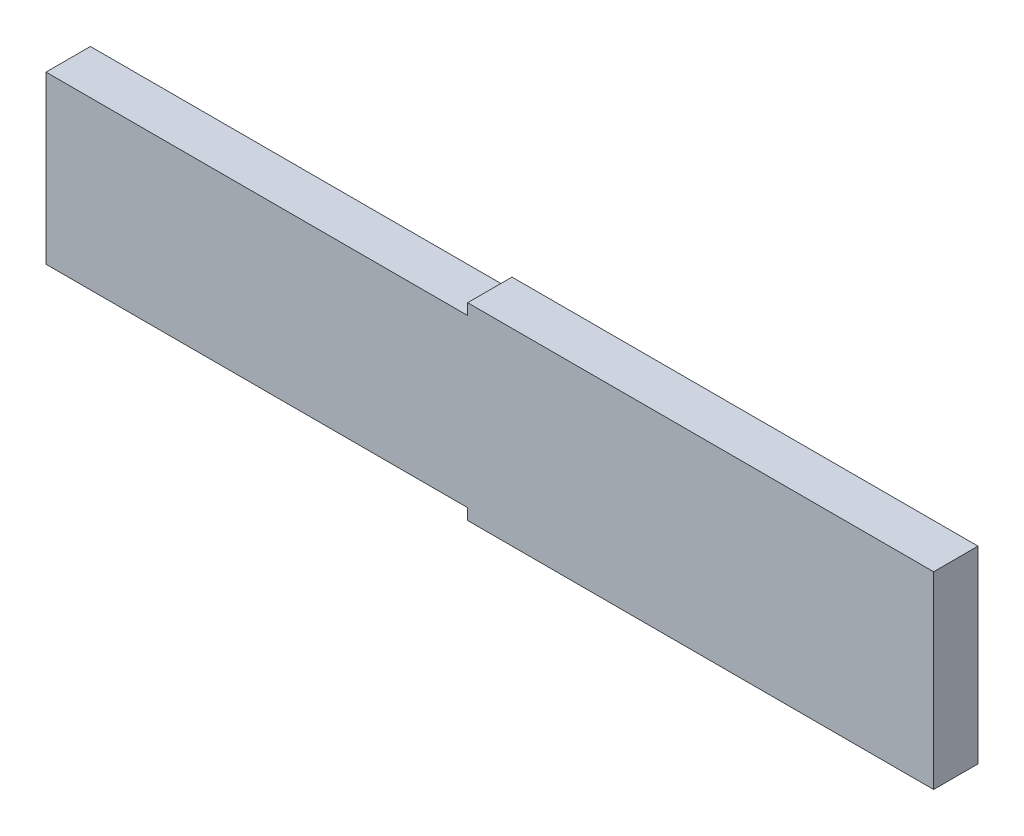
ISO-10303-21;
HEADER;
FILE_DESCRIPTION(('STEP AP214'),'2;1');
FILE_NAME('part.step','',(''),(''),'','','');
FILE_SCHEMA(('AUTOMOTIVE_DESIGN { 1 0 10303 214 1 1 1 1 }'));
ENDSEC;
DATA;
#1=APPLICATION_CONTEXT('core data for automotive mechanical design processes');
#2=APPLICATION_PROTOCOL_DEFINITION('international standard','automotive_design',2000,#1);
#3=PRODUCT_CONTEXT('',#1,'mechanical');
#4=PRODUCT('Part','Part','',(#3));
#5=PRODUCT_RELATED_PRODUCT_CATEGORY('part','',(#4));
#6=PRODUCT_DEFINITION_FORMATION('','',#4);
#7=PRODUCT_DEFINITION_CONTEXT('part definition',#1,'design');
#8=PRODUCT_DEFINITION('design','',#6,#7);
#9=PRODUCT_DEFINITION_SHAPE('','',#8);
#10=(LENGTH_UNIT() NAMED_UNIT(*) SI_UNIT(.MILLI.,.METRE.));
#11=(NAMED_UNIT(*) PLANE_ANGLE_UNIT() SI_UNIT($,.RADIAN.));
#12=(NAMED_UNIT(*) SI_UNIT($,.STERADIAN.) SOLID_ANGLE_UNIT());
#13=UNCERTAINTY_MEASURE_WITH_UNIT(LENGTH_MEASURE(1.E-05),#10,'distance_accuracy_value','');
#14=(GEOMETRIC_REPRESENTATION_CONTEXT(3) GLOBAL_UNCERTAINTY_ASSIGNED_CONTEXT((#13)) GLOBAL_UNIT_ASSIGNED_CONTEXT((#10,
#11,#12)) REPRESENTATION_CONTEXT('',''));
#15=CARTESIAN_POINT('',(0.,0.,0.));
#16=DIRECTION('',(0.,0.,1.));
#17=DIRECTION('',(1.,0.,0.));
#18=AXIS2_PLACEMENT_3D('',#15,#16,#17);
#19=CARTESIAN_POINT('',(-38.,7.5,4.));
#20=DIRECTION('',(0.,-1.,0.));
#21=DIRECTION('',(0.,0.,-1.));
#22=AXIS2_PLACEMENT_3D('',#19,#20,#21);
#23=PLANE('',#22);
#24=DIRECTION('',(-1.,0.,0.));
#25=VECTOR('',#24,1.);
#26=CARTESIAN_POINT('',(-38.,7.5,0.));
#27=LINE('',#26,#25);
#28=CARTESIAN_POINT('',(0.,7.5,0.));
#29=VERTEX_POINT('',#28);
#30=CARTESIAN_POINT('',(-38.,7.5,0.));
#31=VERTEX_POINT('',#30);
#32=EDGE_CURVE('E129',#29,#31,#27,.T.);
#33=ORIENTED_EDGE('',*,*,#32,.T.);
#34=DIRECTION('',(0.,0.,-1.));
#35=VECTOR('',#34,1.);
#36=CARTESIAN_POINT('',(-38.,7.5,4.));
#37=LINE('',#36,#35);
#38=CARTESIAN_POINT('',(-38.,7.5,4.));
#39=VERTEX_POINT('',#38);
#40=EDGE_CURVE('E11',#39,#31,#37,.T.);
#41=ORIENTED_EDGE('',*,*,#40,.F.);
#42=DIRECTION('',(-1.,0.,0.));
#43=VECTOR('',#42,1.);
#44=CARTESIAN_POINT('',(-38.,7.5,4.));
#45=LINE('',#44,#43);
#46=CARTESIAN_POINT('',(0.,7.5,4.));
#47=VERTEX_POINT('',#46);
#48=EDGE_CURVE('E143',#47,#39,#45,.T.);
#49=ORIENTED_EDGE('',*,*,#48,.F.);
#50=DIRECTION('',(0.,0.,-1.));
#51=VECTOR('',#50,1.);
#52=CARTESIAN_POINT('',(0.,7.5,4.));
#53=LINE('',#52,#51);
#54=EDGE_CURVE('E125',#47,#29,#53,.T.);
#55=ORIENTED_EDGE('',*,*,#54,.T.);
#56=EDGE_LOOP('',(#33,#41,#49,#55));
#57=FACE_BOUND('',#56,.T.);
#58=ADVANCED_FACE('F33',(#57),#23,.F.);
#59=CARTESIAN_POINT('',(-38.,-7.5,4.));
#60=DIRECTION('',(1.,0.,0.));
#61=DIRECTION('',(0.,0.,-1.));
#62=AXIS2_PLACEMENT_3D('',#59,#60,#61);
#63=PLANE('',#62);
#64=DIRECTION('',(0.,-1.,0.));
#65=VECTOR('',#64,1.);
#66=CARTESIAN_POINT('',(-38.,-7.5,0.));
#67=LINE('',#66,#65);
#68=CARTESIAN_POINT('',(-38.,-7.5,0.));
#69=VERTEX_POINT('',#68);
#70=EDGE_CURVE('E132',#31,#69,#67,.T.);
#71=ORIENTED_EDGE('',*,*,#70,.T.);
#72=DIRECTION('',(0.,0.,-1.));
#73=VECTOR('',#72,1.);
#74=CARTESIAN_POINT('',(-38.,-7.5,4.));
#75=LINE('',#74,#73);
#76=CARTESIAN_POINT('',(-38.,-7.5,4.));
#77=VERTEX_POINT('',#76);
#78=EDGE_CURVE('E41',#77,#69,#75,.T.);
#79=ORIENTED_EDGE('',*,*,#78,.F.);
#80=DIRECTION('',(0.,-1.,0.));
#81=VECTOR('',#80,1.);
#82=CARTESIAN_POINT('',(-38.,-7.5,4.));
#83=LINE('',#82,#81);
#84=EDGE_CURVE('E92',#39,#77,#83,.T.);
#85=ORIENTED_EDGE('',*,*,#84,.F.);
#86=ORIENTED_EDGE('',*,*,#40,.T.);
#87=EDGE_LOOP('',(#71,#79,#85,#86));
#88=FACE_BOUND('',#87,.T.);
#89=ADVANCED_FACE('F178',(#88),#63,.F.);
#90=CARTESIAN_POINT('',(-38.,-7.5,4.));
#91=DIRECTION('',(0.,1.,0.));
#92=DIRECTION('',(0.,0.,1.));
#93=AXIS2_PLACEMENT_3D('',#90,#91,#92);
#94=PLANE('',#93);
#95=DIRECTION('',(1.,0.,0.));
#96=VECTOR('',#95,1.);
#97=CARTESIAN_POINT('',(-38.,-7.5,0.));
#98=LINE('',#97,#96);
#99=CARTESIAN_POINT('',(0.,-7.5,0.));
#100=VERTEX_POINT('',#99);
#101=EDGE_CURVE('E134',#69,#100,#98,.T.);
#102=ORIENTED_EDGE('',*,*,#101,.T.);
#103=DIRECTION('',(0.,0.,-1.));
#104=VECTOR('',#103,1.);
#105=CARTESIAN_POINT('',(0.,-7.5,4.));
#106=LINE('',#105,#104);
#107=CARTESIAN_POINT('',(0.,-7.5,4.));
#108=VERTEX_POINT('',#107);
#109=EDGE_CURVE('E150',#108,#100,#106,.T.);
#110=ORIENTED_EDGE('',*,*,#109,.F.);
#111=DIRECTION('',(1.,0.,0.));
#112=VECTOR('',#111,1.);
#113=CARTESIAN_POINT('',(-38.,-7.5,4.));
#114=LINE('',#113,#112);
#115=EDGE_CURVE('E158',#77,#108,#114,.T.);
#116=ORIENTED_EDGE('',*,*,#115,.F.);
#117=ORIENTED_EDGE('',*,*,#78,.T.);
#118=EDGE_LOOP('',(#102,#110,#116,#117));
#119=FACE_BOUND('',#118,.T.);
#120=ADVANCED_FACE('F156',(#119),#94,.F.);
#121=CARTESIAN_POINT('',(0.,-7.5,4.));
#122=DIRECTION('',(1.,0.,0.));
#123=DIRECTION('',(0.,0.,-1.));
#124=AXIS2_PLACEMENT_3D('',#121,#122,#123);
#125=PLANE('',#124);
#126=DIRECTION('',(0.,-1.,0.));
#127=VECTOR('',#126,1.);
#128=CARTESIAN_POINT('',(0.,-7.5,0.));
#129=LINE('',#128,#127);
#130=CARTESIAN_POINT('',(0.,-8.50000000000001,0.));
#131=VERTEX_POINT('',#130);
#132=EDGE_CURVE('E136',#100,#131,#129,.T.);
#133=ORIENTED_EDGE('',*,*,#132,.T.);
#134=DIRECTION('',(0.,0.,-1.));
#135=VECTOR('',#134,1.);
#136=CARTESIAN_POINT('',(0.,-8.50000000000001,4.));
#137=LINE('',#136,#135);
#138=CARTESIAN_POINT('',(0.,-8.50000000000001,4.));
#139=VERTEX_POINT('',#138);
#140=EDGE_CURVE('E147',#139,#131,#137,.T.);
#141=ORIENTED_EDGE('',*,*,#140,.F.);
#142=DIRECTION('',(0.,-1.,0.));
#143=VECTOR('',#142,1.);
#144=CARTESIAN_POINT('',(0.,-7.5,4.));
#145=LINE('',#144,#143);
#146=EDGE_CURVE('E170',#108,#139,#145,.T.);
#147=ORIENTED_EDGE('',*,*,#146,.F.);
#148=ORIENTED_EDGE('',*,*,#109,.T.);
#149=EDGE_LOOP('',(#133,#141,#147,#148));
#150=FACE_BOUND('',#149,.T.);
#151=ADVANCED_FACE('F166',(#150),#125,.F.);
#152=CARTESIAN_POINT('',(0.,-8.50000000000001,4.));
#153=DIRECTION('',(0.,1.,0.));
#154=DIRECTION('',(0.,0.,1.));
#155=AXIS2_PLACEMENT_3D('',#152,#153,#154);
#156=PLANE('',#155);
#157=DIRECTION('',(1.,0.,0.));
#158=VECTOR('',#157,1.);
#159=CARTESIAN_POINT('',(0.,-8.50000000000001,0.));
#160=LINE('',#159,#158);
#161=CARTESIAN_POINT('',(42.,-8.50000000000001,0.));
#162=VERTEX_POINT('',#161);
#163=EDGE_CURVE('E138',#131,#162,#160,.T.);
#164=ORIENTED_EDGE('',*,*,#163,.T.);
#165=DIRECTION('',(0.,0.,-1.));
#166=VECTOR('',#165,1.);
#167=CARTESIAN_POINT('',(42.,-8.50000000000001,4.));
#168=LINE('',#167,#166);
#169=CARTESIAN_POINT('',(42.,-8.50000000000001,4.));
#170=VERTEX_POINT('',#169);
#171=EDGE_CURVE('E120',#170,#162,#168,.T.);
#172=ORIENTED_EDGE('',*,*,#171,.F.);
#173=DIRECTION('',(1.,0.,0.));
#174=VECTOR('',#173,1.);
#175=CARTESIAN_POINT('',(0.,-8.50000000000001,4.));
#176=LINE('',#175,#174);
#177=EDGE_CURVE('E111',#139,#170,#176,.T.);
#178=ORIENTED_EDGE('',*,*,#177,.F.);
#179=ORIENTED_EDGE('',*,*,#140,.T.);
#180=EDGE_LOOP('',(#164,#172,#178,#179));
#181=FACE_BOUND('',#180,.T.);
#182=ADVANCED_FACE('F169',(#181),#156,.F.);
#183=CARTESIAN_POINT('',(42.,8.50000000000001,4.));
#184=DIRECTION('',(-1.,0.,0.));
#185=DIRECTION('',(0.,0.,1.));
#186=AXIS2_PLACEMENT_3D('',#183,#184,#185);
#187=PLANE('',#186);
#188=DIRECTION('',(0.,1.,0.));
#189=VECTOR('',#188,1.);
#190=CARTESIAN_POINT('',(42.,8.50000000000001,0.));
#191=LINE('',#190,#189);
#192=CARTESIAN_POINT('',(42.,8.50000000000001,0.));
#193=VERTEX_POINT('',#192);
#194=EDGE_CURVE('E119',#162,#193,#191,.T.);
#195=ORIENTED_EDGE('',*,*,#194,.T.);
#196=DIRECTION('',(0.,0.,-1.));
#197=VECTOR('',#196,1.);
#198=CARTESIAN_POINT('',(42.,8.50000000000001,4.));
#199=LINE('',#198,#197);
#200=CARTESIAN_POINT('',(42.,8.50000000000001,4.));
#201=VERTEX_POINT('',#200);
#202=EDGE_CURVE('E116',#201,#193,#199,.T.);
#203=ORIENTED_EDGE('',*,*,#202,.F.);
#204=DIRECTION('',(0.,1.,0.));
#205=VECTOR('',#204,1.);
#206=CARTESIAN_POINT('',(42.,8.50000000000001,4.));
#207=LINE('',#206,#205);
#208=EDGE_CURVE('E105',#170,#201,#207,.T.);
#209=ORIENTED_EDGE('',*,*,#208,.F.);
#210=ORIENTED_EDGE('',*,*,#171,.T.);
#211=EDGE_LOOP('',(#195,#203,#209,#210));
#212=FACE_BOUND('',#211,.T.);
#213=ADVANCED_FACE('F117',(#212),#187,.F.);
#214=CARTESIAN_POINT('',(0.,8.50000000000001,4.));
#215=DIRECTION('',(0.,-1.,0.));
#216=DIRECTION('',(0.,0.,-1.));
#217=AXIS2_PLACEMENT_3D('',#214,#215,#216);
#218=PLANE('',#217);
#219=DIRECTION('',(-1.,0.,0.));
#220=VECTOR('',#219,1.);
#221=CARTESIAN_POINT('',(0.,8.50000000000001,0.));
#222=LINE('',#221,#220);
#223=CARTESIAN_POINT('',(0.,8.50000000000001,0.));
#224=VERTEX_POINT('',#223);
#225=EDGE_CURVE('E78',#193,#224,#222,.T.);
#226=ORIENTED_EDGE('',*,*,#225,.T.);
#227=DIRECTION('',(0.,0.,-1.));
#228=VECTOR('',#227,1.);
#229=CARTESIAN_POINT('',(0.,8.50000000000001,4.));
#230=LINE('',#229,#228);
#231=CARTESIAN_POINT('',(0.,8.50000000000001,4.));
#232=VERTEX_POINT('',#231);
#233=EDGE_CURVE('E121',#232,#224,#230,.T.);
#234=ORIENTED_EDGE('',*,*,#233,.F.);
#235=DIRECTION('',(-1.,0.,0.));
#236=VECTOR('',#235,1.);
#237=CARTESIAN_POINT('',(0.,8.50000000000001,4.));
#238=LINE('',#237,#236);
#239=EDGE_CURVE('E109',#201,#232,#238,.T.);
#240=ORIENTED_EDGE('',*,*,#239,.F.);
#241=ORIENTED_EDGE('',*,*,#202,.T.);
#242=EDGE_LOOP('',(#226,#234,#240,#241));
#243=FACE_BOUND('',#242,.T.);
#244=ADVANCED_FACE('F123',(#243),#218,.F.);
#245=CARTESIAN_POINT('',(0.,7.5,4.));
#246=DIRECTION('',(1.,0.,0.));
#247=DIRECTION('',(0.,0.,-1.));
#248=AXIS2_PLACEMENT_3D('',#245,#246,#247);
#249=PLANE('',#248);
#250=DIRECTION('',(0.,-1.,0.));
#251=VECTOR('',#250,1.);
#252=CARTESIAN_POINT('',(0.,7.5,0.));
#253=LINE('',#252,#251);
#254=EDGE_CURVE('E84',#224,#29,#253,.T.);
#255=ORIENTED_EDGE('',*,*,#254,.T.);
#256=ORIENTED_EDGE('',*,*,#54,.F.);
#257=DIRECTION('',(0.,-1.,0.));
#258=VECTOR('',#257,1.);
#259=CARTESIAN_POINT('',(0.,7.5,4.));
#260=LINE('',#259,#258);
#261=EDGE_CURVE('E49',#232,#47,#260,.T.);
#262=ORIENTED_EDGE('',*,*,#261,.F.);
#263=ORIENTED_EDGE('',*,*,#233,.T.);
#264=EDGE_LOOP('',(#255,#256,#262,#263));
#265=FACE_BOUND('',#264,.T.);
#266=ADVANCED_FACE('F194',(#265),#249,.F.);
#267=CARTESIAN_POINT('',(0.,0.,4.));
#268=DIRECTION('',(0.,0.,1.));
#269=DIRECTION('',(1.,0.,0.));
#270=AXIS2_PLACEMENT_3D('',#267,#268,#269);
#271=PLANE('',#270);
#272=ORIENTED_EDGE('',*,*,#48,.T.);
#273=ORIENTED_EDGE('',*,*,#84,.T.);
#274=ORIENTED_EDGE('',*,*,#115,.T.);
#275=ORIENTED_EDGE('',*,*,#146,.T.);
#276=ORIENTED_EDGE('',*,*,#177,.T.);
#277=ORIENTED_EDGE('',*,*,#208,.T.);
#278=ORIENTED_EDGE('',*,*,#239,.T.);
#279=ORIENTED_EDGE('',*,*,#261,.T.);
#280=EDGE_LOOP('',(#272,#273,#274,#275,#276,#277,#278,#279));
#281=FACE_BOUND('',#280,.T.);
#282=ADVANCED_FACE('F107',(#281),#271,.T.);
#283=CARTESIAN_POINT('',(0.,0.,0.));
#284=DIRECTION('',(0.,0.,1.));
#285=DIRECTION('',(1.,0.,0.));
#286=AXIS2_PLACEMENT_3D('',#283,#284,#285);
#287=PLANE('',#286);
#288=ORIENTED_EDGE('',*,*,#32,.F.);
#289=ORIENTED_EDGE('',*,*,#254,.F.);
#290=ORIENTED_EDGE('',*,*,#225,.F.);
#291=ORIENTED_EDGE('',*,*,#194,.F.);
#292=ORIENTED_EDGE('',*,*,#163,.F.);
#293=ORIENTED_EDGE('',*,*,#132,.F.);
#294=ORIENTED_EDGE('',*,*,#101,.F.);
#295=ORIENTED_EDGE('',*,*,#70,.F.);
#296=EDGE_LOOP('',(#288,#289,#290,#291,#292,#293,#294,#295));
#297=FACE_BOUND('',#296,.T.);
#298=ADVANCED_FACE('F162',(#297),#287,.F.);
#299=CLOSED_SHELL('',(#58,#89,#120,#151,#182,#213,#244,#266,#282,#298));
#300=MANIFOLD_SOLID_BREP('B2',#299);
#301=ADVANCED_BREP_SHAPE_REPRESENTATION('',(#18,#300),#14);
#302=SHAPE_DEFINITION_REPRESENTATION(#9,#301);
ENDSEC;
END-ISO-10303-21;
